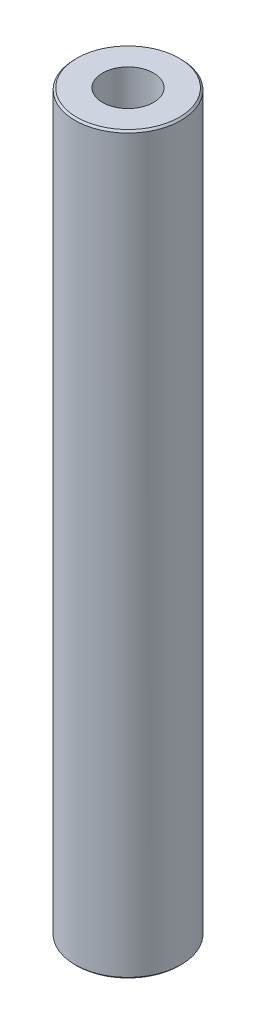
ISO-10303-21;
HEADER;
FILE_DESCRIPTION(('STEP AP214'),'2;1');
FILE_NAME('part.step','',(''),(''),'','','');
FILE_SCHEMA(('AUTOMOTIVE_DESIGN { 1 0 10303 214 1 1 1 1 }'));
ENDSEC;
DATA;
#1=APPLICATION_CONTEXT('core data for automotive mechanical design processes');
#2=APPLICATION_PROTOCOL_DEFINITION('international standard','automotive_design',2000,#1);
#3=PRODUCT_CONTEXT('',#1,'mechanical');
#4=PRODUCT('Part','Part','',(#3));
#5=PRODUCT_RELATED_PRODUCT_CATEGORY('part','',(#4));
#6=PRODUCT_DEFINITION_FORMATION('','',#4);
#7=PRODUCT_DEFINITION_CONTEXT('part definition',#1,'design');
#8=PRODUCT_DEFINITION('design','',#6,#7);
#9=PRODUCT_DEFINITION_SHAPE('','',#8);
#10=(LENGTH_UNIT() NAMED_UNIT(*) SI_UNIT(.MILLI.,.METRE.));
#11=(NAMED_UNIT(*) PLANE_ANGLE_UNIT() SI_UNIT($,.RADIAN.));
#12=(NAMED_UNIT(*) SI_UNIT($,.STERADIAN.) SOLID_ANGLE_UNIT());
#13=UNCERTAINTY_MEASURE_WITH_UNIT(LENGTH_MEASURE(1.E-05),#10,'distance_accuracy_value','');
#14=(GEOMETRIC_REPRESENTATION_CONTEXT(3) GLOBAL_UNCERTAINTY_ASSIGNED_CONTEXT((#13)) GLOBAL_UNIT_ASSIGNED_CONTEXT((#10,
#11,#12)) REPRESENTATION_CONTEXT('',''));
#15=CARTESIAN_POINT('',(0.,0.,0.));
#16=DIRECTION('',(0.,0.,1.));
#17=DIRECTION('',(1.,0.,0.));
#18=AXIS2_PLACEMENT_3D('',#15,#16,#17);
#19=CARTESIAN_POINT('',(0.,207.952165960628,0.));
#20=DIRECTION('',(0.,-1.,0.));
#21=DIRECTION('',(0.,0.,-1.));
#22=AXIS2_PLACEMENT_3D('',#19,#20,#21);
#23=CYLINDRICAL_SURFACE('',#22,15.);
#24=CARTESIAN_POINT('',(0.,207.442985497234,0.));
#25=DIRECTION('',(0.,1.,0.));
#26=DIRECTION('',(0.,0.,1.));
#27=AXIS2_PLACEMENT_3D('',#24,#25,#26);
#28=CIRCLE('',#27,15.);
#29=CARTESIAN_POINT('',(0.,207.442985497234,-15.));
#30=VERTEX_POINT('',#29);
#31=EDGE_CURVE('E50',#30,#30,#28,.F.);
#32=CARTESIAN_POINT('',(0.,0.509180463394598,0.));
#33=DIRECTION('',(0.,1.,0.));
#34=DIRECTION('',(0.,0.,1.));
#35=AXIS2_PLACEMENT_3D('',#32,#33,#34);
#36=CIRCLE('',#35,15.);
#37=CARTESIAN_POINT('',(0.,0.509180463394598,-15.));
#38=VERTEX_POINT('',#37);
#39=EDGE_CURVE('E51',#38,#38,#36,.T.);
#40=CARTESIAN_POINT('',(0.,207.442985497234,-15.));
#41=CARTESIAN_POINT('',(0.,205.287425028131,-15.));
#42=CARTESIAN_POINT('',(0.,203.131864559029,-15.));
#43=CARTESIAN_POINT('',(0.,198.820743620824,-15.));
#44=CARTESIAN_POINT('',(0.,196.665183151721,-15.));
#45=CARTESIAN_POINT('',(0.,192.354062213516,-15.));
#46=CARTESIAN_POINT('',(0.,190.198501744414,-15.));
#47=CARTESIAN_POINT('',(0.,185.887380806209,-15.));
#48=CARTESIAN_POINT('',(0.,183.731820337106,-15.));
#49=CARTESIAN_POINT('',(0.,179.420699398901,-15.));
#50=CARTESIAN_POINT('',(0.,177.265138929799,-15.));
#51=CARTESIAN_POINT('',(0.,172.954017991594,-15.));
#52=CARTESIAN_POINT('',(0.,170.798457522491,-15.));
#53=CARTESIAN_POINT('',(0.,166.487336584286,-15.));
#54=CARTESIAN_POINT('',(0.,164.331776115184,-15.));
#55=CARTESIAN_POINT('',(0.,160.020655176979,-15.));
#56=CARTESIAN_POINT('',(0.,157.865094707876,-15.));
#57=CARTESIAN_POINT('',(0.,153.553973769671,-15.));
#58=CARTESIAN_POINT('',(0.,151.398413300569,-15.));
#59=CARTESIAN_POINT('',(0.,147.087292362364,-15.));
#60=CARTESIAN_POINT('',(0.,144.931731893261,-15.));
#61=CARTESIAN_POINT('',(0.,140.620610955057,-15.));
#62=CARTESIAN_POINT('',(0.,138.465050485954,-15.));
#63=CARTESIAN_POINT('',(0.,134.153929547749,-15.));
#64=CARTESIAN_POINT('',(0.,131.998369078647,-15.));
#65=CARTESIAN_POINT('',(0.,127.687248140442,-15.));
#66=CARTESIAN_POINT('',(0.,125.531687671339,-15.));
#67=CARTESIAN_POINT('',(0.,121.220566733134,-15.));
#68=CARTESIAN_POINT('',(0.,119.065006264032,-15.));
#69=CARTESIAN_POINT('',(0.,114.753885325827,-15.));
#70=CARTESIAN_POINT('',(0.,112.598324856724,-15.));
#71=CARTESIAN_POINT('',(0.,108.287203918519,-15.));
#72=CARTESIAN_POINT('',(0.,106.131643449417,-15.));
#73=CARTESIAN_POINT('',(0.,101.820522511212,-15.));
#74=CARTESIAN_POINT('',(0.,99.6649620421092,-15.));
#75=CARTESIAN_POINT('',(0.,95.3538411039042,-15.));
#76=CARTESIAN_POINT('',(0.,93.1982806348017,-15.));
#77=CARTESIAN_POINT('',(0.,88.8871596965967,-15.));
#78=CARTESIAN_POINT('',(0.,86.7315992274942,-15.));
#79=CARTESIAN_POINT('',(0.,82.4204782892892,-15.));
#80=CARTESIAN_POINT('',(0.,80.2649178201868,-15.));
#81=CARTESIAN_POINT('',(0.,75.9537968819818,-15.));
#82=CARTESIAN_POINT('',(0.,73.7982364128793,-15.));
#83=CARTESIAN_POINT('',(0.,69.4871154746743,-15.));
#84=CARTESIAN_POINT('',(0.,67.3315550055718,-15.));
#85=CARTESIAN_POINT('',(0.,63.0204340673668,-15.));
#86=CARTESIAN_POINT('',(0.,60.8648735982643,-15.));
#87=CARTESIAN_POINT('',(0.,56.5537526600594,-15.));
#88=CARTESIAN_POINT('',(0.,54.3981921909569,-15.));
#89=CARTESIAN_POINT('',(0.,50.0870712527519,-15.));
#90=CARTESIAN_POINT('',(0.,47.9315107836494,-15.));
#91=CARTESIAN_POINT('',(0.,43.6203898454444,-15.));
#92=CARTESIAN_POINT('',(0.,41.4648293763419,-15.));
#93=CARTESIAN_POINT('',(0.,37.1537084381369,-15.));
#94=CARTESIAN_POINT('',(0.,34.9981479690344,-15.));
#95=CARTESIAN_POINT('',(0.,30.6870270308295,-15.));
#96=CARTESIAN_POINT('',(0.,28.531466561727,-15.));
#97=CARTESIAN_POINT('',(0.,24.220345623522,-15.));
#98=CARTESIAN_POINT('',(0.,22.0647851544195,-15.));
#99=CARTESIAN_POINT('',(0.,17.7536642162145,-15.));
#100=CARTESIAN_POINT('',(0.,15.598103747112,-15.));
#101=CARTESIAN_POINT('',(0.,11.286982808907,-15.));
#102=CARTESIAN_POINT('',(0.,9.13142233980455,-15.));
#103=CARTESIAN_POINT('',(0.,4.82030140159958,-15.));
#104=CARTESIAN_POINT('',(0.,2.66474093249709,-15.));
#105=CARTESIAN_POINT('',(0.,0.509180463394598,-15.));
#106=B_SPLINE_CURVE_WITH_KNOTS('',3,(#40,#41,#42,#43,#44,#45,#46,#47,#48,#49,#50,#51,#52,#53,
#54,#55,#56,#57,#58,#59,#60,#61,#62,#63,#64,#65,#66,#67,#68,#69,#70,#71,#72,#73,#74,#75,#76,#77,
#78,#79,#80,#81,#82,#83,#84,#85,#86,#87,#88,#89,#90,#91,#92,#93,#94,#95,#96,#97,#98,#99,#100,
#101,#102,#103,#104,#105),.UNSPECIFIED.,.F.,.F.,(4,2,2,2,2,2,2,2,2,2,2,2,2,2,2,2,2,2,2,2,2,2,2,
2,2,2,2,2,2,2,2,2,4),(0.,6.46668140730747,12.9333628146149,19.4000442219224,25.8667256292299,
32.3334070365373,38.8000884438448,45.2667698511523,51.7334512584598,58.2001326657672,
64.6668140730747,71.1334954803822,77.6001768876896,84.0668582949971,90.5335397023046,
97.0002211096121,103.46690251692,109.933583924227,116.400265331534,122.866946738842,
129.333628146149,135.800309553457,142.266990960764,148.733672368072,155.200353775379,
161.667035182687,168.133716589994,174.600397997302,181.067079404609,187.533760811917,
194.000442219224,200.467123626532,206.933805033839),.UNSPECIFIED.);
#107=EDGE_CURVE('BSEAM39',#30,#38,#106,.T.);
#108=ORIENTED_EDGE('',*,*,#31,.T.);
#109=ORIENTED_EDGE('',*,*,#39,.T.);
#110=ORIENTED_EDGE('',*,*,#107,.T.);
#111=ORIENTED_EDGE('',*,*,#107,.F.);
#112=EDGE_LOOP('',(#108,#110,#109,#111));
#113=FACE_BOUND('',#112,.T.);
#114=ADVANCED_FACE('F39',(#113),#23,.T.);
#115=CARTESIAN_POINT('',(0.,207.952165960628,0.));
#116=DIRECTION('',(0.,1.,0.));
#117=DIRECTION('',(0.,0.,1.));
#118=AXIS2_PLACEMENT_3D('',#115,#116,#117);
#119=PLANE('',#118);
#120=CARTESIAN_POINT('',(0.,207.952165960628,0.));
#121=DIRECTION('',(0.,1.,0.));
#122=DIRECTION('',(0.,0.,1.));
#123=AXIS2_PLACEMENT_3D('',#120,#121,#122);
#124=CIRCLE('',#123,14.4908195366056);
#125=CARTESIAN_POINT('',(0.,207.952165960628,14.4908195366056));
#126=VERTEX_POINT('',#125);
#127=EDGE_CURVE('E54',#126,#126,#124,.T.);
#128=ORIENTED_EDGE('',*,*,#127,.T.);
#129=EDGE_LOOP('',(#128));
#130=FACE_BOUND('',#129,.T.);
#131=CARTESIAN_POINT('',(0.,207.952165960628,0.));
#132=DIRECTION('',(0.,1.,0.));
#133=DIRECTION('',(0.,0.,1.));
#134=AXIS2_PLACEMENT_3D('',#131,#132,#133);
#135=CIRCLE('',#134,7.22516322089552);
#136=CARTESIAN_POINT('',(0.,207.952165960628,-7.22516322089552));
#137=VERTEX_POINT('',#136);
#138=EDGE_CURVE('E58',#137,#137,#135,.T.);
#139=ORIENTED_EDGE('',*,*,#138,.F.);
#140=EDGE_LOOP('',(#139));
#141=FACE_BOUND('',#140,.T.);
#142=ADVANCED_FACE('F69',(#130,#141),#119,.T.);
#143=CARTESIAN_POINT('',(0.,0.,0.));
#144=DIRECTION('',(0.,1.,0.));
#145=DIRECTION('',(0.,0.,1.));
#146=AXIS2_PLACEMENT_3D('',#143,#144,#145);
#147=PLANE('',#146);
#148=CARTESIAN_POINT('',(0.,0.,0.));
#149=DIRECTION('',(0.,1.,0.));
#150=DIRECTION('',(0.,0.,1.));
#151=AXIS2_PLACEMENT_3D('',#148,#149,#150);
#152=CIRCLE('',#151,14.4908195366054);
#153=CARTESIAN_POINT('',(0.,0.,14.4908195366054));
#154=VERTEX_POINT('',#153);
#155=EDGE_CURVE('E10',#154,#154,#152,.F.);
#156=ORIENTED_EDGE('',*,*,#155,.T.);
#157=EDGE_LOOP('',(#156));
#158=FACE_BOUND('',#157,.T.);
#159=CARTESIAN_POINT('',(0.,0.,0.));
#160=DIRECTION('',(0.,1.,0.));
#161=DIRECTION('',(0.,0.,1.));
#162=AXIS2_PLACEMENT_3D('',#159,#160,#161);
#163=CIRCLE('',#162,7.22516322089552);
#164=CARTESIAN_POINT('',(0.,0.,-7.22516322089552));
#165=VERTEX_POINT('',#164);
#166=EDGE_CURVE('E63',#165,#165,#163,.T.);
#167=ORIENTED_EDGE('',*,*,#166,.T.);
#168=EDGE_LOOP('',(#167));
#169=FACE_BOUND('',#168,.T.);
#170=ADVANCED_FACE('F75',(#158,#169),#147,.F.);
#171=CARTESIAN_POINT('',(0.,207.952165960628,0.));
#172=DIRECTION('',(0.,-1.,0.));
#173=DIRECTION('',(0.,0.,-1.));
#174=AXIS2_PLACEMENT_3D('',#171,#172,#173);
#175=CYLINDRICAL_SURFACE('',#174,7.22516322089552);
#176=CARTESIAN_POINT('',(0.,207.952165960628,-7.22516322089552));
#177=CARTESIAN_POINT('',(0.,205.785997565205,-7.22516322089552));
#178=CARTESIAN_POINT('',(0.,203.619829169782,-7.22516322089552));
#179=CARTESIAN_POINT('',(0.,199.287492378935,-7.22516322089552));
#180=CARTESIAN_POINT('',(0.,197.121323983512,-7.22516322089552));
#181=CARTESIAN_POINT('',(0.,192.788987192666,-7.22516322089552));
#182=CARTESIAN_POINT('',(0.,190.622818797242,-7.22516322089552));
#183=CARTESIAN_POINT('',(0.,186.290482006396,-7.22516322089552));
#184=CARTESIAN_POINT('',(0.,184.124313610973,-7.22516322089552));
#185=CARTESIAN_POINT('',(0.,179.791976820126,-7.22516322089552));
#186=CARTESIAN_POINT('',(0.,177.625808424703,-7.22516322089552));
#187=CARTESIAN_POINT('',(0.,173.293471633857,-7.22516322089552));
#188=CARTESIAN_POINT('',(0.,171.127303238434,-7.22516322089552));
#189=CARTESIAN_POINT('',(0.,166.794966447587,-7.22516322089552));
#190=CARTESIAN_POINT('',(0.,164.628798052164,-7.22516322089552));
#191=CARTESIAN_POINT('',(0.,160.296461261317,-7.22516322089552));
#192=CARTESIAN_POINT('',(0.,158.130292865894,-7.22516322089552));
#193=CARTESIAN_POINT('',(0.,153.797956075048,-7.22516322089552));
#194=CARTESIAN_POINT('',(0.,151.631787679625,-7.22516322089552));
#195=CARTESIAN_POINT('',(0.,147.299450888778,-7.22516322089552));
#196=CARTESIAN_POINT('',(0.,145.133282493355,-7.22516322089552));
#197=CARTESIAN_POINT('',(0.,140.800945702509,-7.22516322089552));
#198=CARTESIAN_POINT('',(0.,138.634777307085,-7.22516322089552));
#199=CARTESIAN_POINT('',(0.,134.302440516239,-7.22516322089552));
#200=CARTESIAN_POINT('',(0.,132.136272120816,-7.22516322089552));
#201=CARTESIAN_POINT('',(0.,127.803935329969,-7.22516322089552));
#202=CARTESIAN_POINT('',(0.,125.637766934546,-7.22516322089552));
#203=CARTESIAN_POINT('',(0.,121.3054301437,-7.22516322089552));
#204=CARTESIAN_POINT('',(0.,119.139261748276,-7.22516322089552));
#205=CARTESIAN_POINT('',(0.,114.80692495743,-7.22516322089552));
#206=CARTESIAN_POINT('',(0.,112.640756562007,-7.22516322089552));
#207=CARTESIAN_POINT('',(0.,108.30841977116,-7.22516322089552));
#208=CARTESIAN_POINT('',(0.,106.142251375737,-7.22516322089552));
#209=CARTESIAN_POINT('',(0.,101.809914584891,-7.22516322089552));
#210=CARTESIAN_POINT('',(0.,99.6437461894676,-7.22516322089552));
#211=CARTESIAN_POINT('',(0.,95.3114093986212,-7.22516322089552));
#212=CARTESIAN_POINT('',(0.,93.145241003198,-7.22516322089552));
#213=CARTESIAN_POINT('',(0.,88.8129042123516,-7.22516322089552));
#214=CARTESIAN_POINT('',(0.,86.6467358169283,-7.22516322089552));
#215=CARTESIAN_POINT('',(0.,82.3143990260819,-7.22516322089552));
#216=CARTESIAN_POINT('',(0.,80.1482306306587,-7.22516322089552));
#217=CARTESIAN_POINT('',(0.,75.8158938398123,-7.22516322089552));
#218=CARTESIAN_POINT('',(0.,73.6497254443891,-7.22516322089552));
#219=CARTESIAN_POINT('',(0.,69.3173886535427,-7.22516322089552));
#220=CARTESIAN_POINT('',(0.,67.1512202581195,-7.22516322089552));
#221=CARTESIAN_POINT('',(0.,62.8188834672731,-7.22516322089552));
#222=CARTESIAN_POINT('',(0.,60.6527150718499,-7.22516322089552));
#223=CARTESIAN_POINT('',(0.,56.3203782810034,-7.22516322089552));
#224=CARTESIAN_POINT('',(0.,54.1542098855802,-7.22516322089552));
#225=CARTESIAN_POINT('',(0.,49.8218730947338,-7.22516322089552));
#226=CARTESIAN_POINT('',(0.,47.6557046993106,-7.22516322089552));
#227=CARTESIAN_POINT('',(0.,43.3233679084642,-7.22516322089552));
#228=CARTESIAN_POINT('',(0.,41.157199513041,-7.22516322089552));
#229=CARTESIAN_POINT('',(0.,36.8248627221945,-7.22516322089552));
#230=CARTESIAN_POINT('',(0.,34.6586943267713,-7.22516322089552));
#231=CARTESIAN_POINT('',(0.,30.3263575359249,-7.22516322089552));
#232=CARTESIAN_POINT('',(0.,28.1601891405017,-7.22516322089552));
#233=CARTESIAN_POINT('',(0.,23.8278523496553,-7.22516322089552));
#234=CARTESIAN_POINT('',(0.,21.6616839542321,-7.22516322089552));
#235=CARTESIAN_POINT('',(0.,17.3293471633857,-7.22516322089552));
#236=CARTESIAN_POINT('',(0.,15.1631787679625,-7.22516322089552));
#237=CARTESIAN_POINT('',(0.,10.830841977116,-7.22516322089552));
#238=CARTESIAN_POINT('',(0.,8.66467358169283,-7.22516322089552));
#239=CARTESIAN_POINT('',(0.,4.33233679084642,-7.22516322089552));
#240=CARTESIAN_POINT('',(0.,2.16616839542321,-7.22516322089552));
#241=CARTESIAN_POINT('',(0.,0.,-7.22516322089552));
#242=B_SPLINE_CURVE_WITH_KNOTS('',3,(#176,#177,#178,#179,#180,#181,#182,#183,#184,#185,#186,
#187,#188,#189,#190,#191,#192,#193,#194,#195,#196,#197,#198,#199,#200,#201,#202,#203,#204,#205,
#206,#207,#208,#209,#210,#211,#212,#213,#214,#215,#216,#217,#218,#219,#220,#221,#222,#223,#224,
#225,#226,#227,#228,#229,#230,#231,#232,#233,#234,#235,#236,#237,#238,#239,#240,#241),
.UNSPECIFIED.,.F.,.F.,(4,2,2,2,2,2,2,2,2,2,2,2,2,2,2,2,2,2,2,2,2,2,2,2,2,2,2,2,2,2,2,2,4),(0.,
6.49850518626965,12.9970103725393,19.4955155588089,25.9940207450785,32.4925259313481,
38.9910311176178,45.4895363038874,51.988041490157,58.4865466764267,64.9850518626963,
71.4835570489659,77.9820622352355,84.4805674215052,90.9790726077748,97.4775777940444,
103.976082980314,110.474588166584,116.973093352853,123.471598539123,129.970103725393,
136.468608911662,142.967114097932,149.465619284201,155.964124470471,162.462629656741,
168.96113484301,175.45964002928,181.95814521555,188.456650401819,194.955155588089,
201.453660774358,207.952165960628),.UNSPECIFIED.);
#243=EDGE_CURVE('BSEAM70',#137,#165,#242,.T.);
#244=ORIENTED_EDGE('',*,*,#138,.T.);
#245=ORIENTED_EDGE('',*,*,#166,.F.);
#246=ORIENTED_EDGE('',*,*,#243,.T.);
#247=ORIENTED_EDGE('',*,*,#243,.F.);
#248=EDGE_LOOP('',(#244,#246,#245,#247));
#249=FACE_BOUND('',#248,.T.);
#250=ADVANCED_FACE('F70',(#249),#175,.F.);
#251=CARTESIAN_POINT('',(0.,207.952165960628,0.));
#252=DIRECTION('',(0.,-1.,0.));
#253=DIRECTION('',(0.,0.,-1.));
#254=AXIS2_PLACEMENT_3D('',#251,#252,#253);
#255=CONICAL_SURFACE('',#254,14.4908195366056,0.785398163397464);
#256=ORIENTED_EDGE('',*,*,#31,.F.);
#257=EDGE_LOOP('',(#256));
#258=FACE_BOUND('',#257,.T.);
#259=ORIENTED_EDGE('',*,*,#127,.F.);
#260=EDGE_LOOP('',(#259));
#261=FACE_BOUND('',#260,.T.);
#262=ADVANCED_FACE('F81',(#258,#261),#255,.T.);
#263=CARTESIAN_POINT('',(0.,0.509180463394598,0.));
#264=DIRECTION('',(0.,1.,0.));
#265=DIRECTION('',(0.,0.,1.));
#266=AXIS2_PLACEMENT_3D('',#263,#264,#265);
#267=CONICAL_SURFACE('',#266,15.,0.785398163397465);
#268=ORIENTED_EDGE('',*,*,#155,.F.);
#269=EDGE_LOOP('',(#268));
#270=FACE_BOUND('',#269,.T.);
#271=ORIENTED_EDGE('',*,*,#39,.F.);
#272=EDGE_LOOP('',(#271));
#273=FACE_BOUND('',#272,.T.);
#274=ADVANCED_FACE('F45',(#270,#273),#267,.T.);
#275=CLOSED_SHELL('',(#114,#142,#170,#250,#262,#274));
#276=MANIFOLD_SOLID_BREP('B2',#275);
#277=ADVANCED_BREP_SHAPE_REPRESENTATION('',(#18,#276),#14);
#278=SHAPE_DEFINITION_REPRESENTATION(#9,#277);
ENDSEC;
END-ISO-10303-21;
